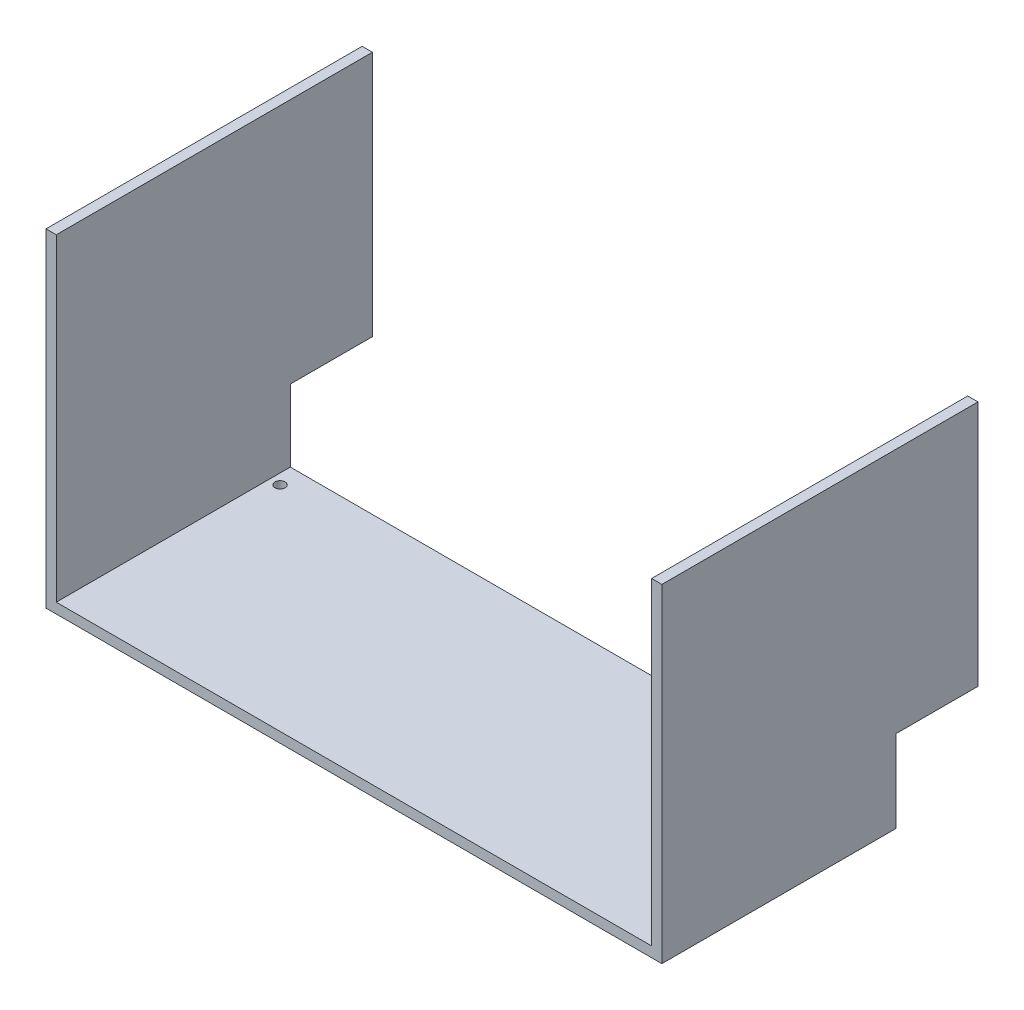
ISO-10303-21;
HEADER;
FILE_DESCRIPTION(('STEP AP214'),'2;1');
FILE_NAME('part.step','',(''),(''),'','','');
FILE_SCHEMA(('AUTOMOTIVE_DESIGN { 1 0 10303 214 1 1 1 1 }'));
ENDSEC;
DATA;
#1=APPLICATION_CONTEXT('core data for automotive mechanical design processes');
#2=APPLICATION_PROTOCOL_DEFINITION('international standard','automotive_design',2000,#1);
#3=PRODUCT_CONTEXT('',#1,'mechanical');
#4=PRODUCT('Part','Part','',(#3));
#5=PRODUCT_RELATED_PRODUCT_CATEGORY('part','',(#4));
#6=PRODUCT_DEFINITION_FORMATION('','',#4);
#7=PRODUCT_DEFINITION_CONTEXT('part definition',#1,'design');
#8=PRODUCT_DEFINITION('design','',#6,#7);
#9=PRODUCT_DEFINITION_SHAPE('','',#8);
#10=(LENGTH_UNIT() NAMED_UNIT(*) SI_UNIT(.MILLI.,.METRE.));
#11=(NAMED_UNIT(*) PLANE_ANGLE_UNIT() SI_UNIT($,.RADIAN.));
#12=(NAMED_UNIT(*) SI_UNIT($,.STERADIAN.) SOLID_ANGLE_UNIT());
#13=UNCERTAINTY_MEASURE_WITH_UNIT(LENGTH_MEASURE(1.E-05),#10,'distance_accuracy_value','');
#14=(GEOMETRIC_REPRESENTATION_CONTEXT(3) GLOBAL_UNCERTAINTY_ASSIGNED_CONTEXT((#13)) GLOBAL_UNIT_ASSIGNED_CONTEXT((#10,
#11,#12)) REPRESENTATION_CONTEXT('',''));
#15=CARTESIAN_POINT('',(0.,0.,0.));
#16=DIRECTION('',(0.,0.,1.));
#17=DIRECTION('',(1.,0.,0.));
#18=AXIS2_PLACEMENT_3D('',#15,#16,#17);
#19=CARTESIAN_POINT('',(0.,6.35,-429.26));
#20=DIRECTION('',(0.,0.,1.));
#21=DIRECTION('',(1.,0.,0.));
#22=AXIS2_PLACEMENT_3D('',#19,#20,#21);
#23=PLANE('',#22);
#24=DIRECTION('',(0.,1.,0.));
#25=VECTOR('',#24,1.);
#26=CARTESIAN_POINT('',(374.65,177.8,-429.26));
#27=LINE('',#26,#25);
#28=CARTESIAN_POINT('',(374.65,6.35,-429.26));
#29=VERTEX_POINT('',#28);
#30=CARTESIAN_POINT('',(374.65,50.8,-429.26));
#31=VERTEX_POINT('',#30);
#32=EDGE_CURVE('E146',#29,#31,#27,.T.);
#33=ORIENTED_EDGE('',*,*,#32,.T.);
#34=DIRECTION('',(-1.,0.,0.));
#35=VECTOR('',#34,1.);
#36=CARTESIAN_POINT('',(381.,50.8,-429.26));
#37=LINE('',#36,#35);
#38=CARTESIAN_POINT('',(381.,50.8,-429.26));
#39=VERTEX_POINT('',#38);
#40=EDGE_CURVE('E221',#39,#31,#37,.T.);
#41=ORIENTED_EDGE('',*,*,#40,.F.);
#42=DIRECTION('',(0.,-1.,0.));
#43=VECTOR('',#42,1.);
#44=CARTESIAN_POINT('',(381.,177.8,-429.26));
#45=LINE('',#44,#43);
#46=CARTESIAN_POINT('',(381.,0.,-429.26));
#47=VERTEX_POINT('',#46);
#48=EDGE_CURVE('E179',#39,#47,#45,.T.);
#49=ORIENTED_EDGE('',*,*,#48,.T.);
#50=DIRECTION('',(-1.,0.,0.));
#51=VECTOR('',#50,1.);
#52=CARTESIAN_POINT('',(0.,0.,-429.26));
#53=LINE('',#52,#51);
#54=CARTESIAN_POINT('',(0.,0.,-429.26));
#55=VERTEX_POINT('',#54);
#56=EDGE_CURVE('E41',#47,#55,#53,.T.);
#57=ORIENTED_EDGE('',*,*,#56,.T.);
#58=DIRECTION('',(0.,1.,0.));
#59=VECTOR('',#58,1.);
#60=CARTESIAN_POINT('',(0.,165.1,-429.26));
#61=LINE('',#60,#59);
#62=CARTESIAN_POINT('',(0.,50.8,-429.26));
#63=VERTEX_POINT('',#62);
#64=EDGE_CURVE('E181',#55,#63,#61,.T.);
#65=ORIENTED_EDGE('',*,*,#64,.T.);
#66=DIRECTION('',(-1.,0.,0.));
#67=VECTOR('',#66,1.);
#68=CARTESIAN_POINT('',(6.35,50.8,-429.26));
#69=LINE('',#68,#67);
#70=CARTESIAN_POINT('',(6.35,50.8,-429.26));
#71=VERTEX_POINT('',#70);
#72=EDGE_CURVE('E49',#71,#63,#69,.T.);
#73=ORIENTED_EDGE('',*,*,#72,.F.);
#74=DIRECTION('',(0.,-1.,0.));
#75=VECTOR('',#74,1.);
#76=CARTESIAN_POINT('',(6.35,165.1,-429.26));
#77=LINE('',#76,#75);
#78=CARTESIAN_POINT('',(6.35,6.34999999999999,-429.26));
#79=VERTEX_POINT('',#78);
#80=EDGE_CURVE('E158',#71,#79,#77,.T.);
#81=ORIENTED_EDGE('',*,*,#80,.T.);
#82=DIRECTION('',(-1.,0.,0.));
#83=VECTOR('',#82,1.);
#84=CARTESIAN_POINT('',(0.,6.35,-429.26));
#85=LINE('',#84,#83);
#86=EDGE_CURVE('E11',#29,#79,#85,.T.);
#87=ORIENTED_EDGE('',*,*,#86,.F.);
#88=EDGE_LOOP('',(#33,#41,#49,#57,#65,#73,#81,#87));
#89=FACE_BOUND('',#88,.T.);
#90=ADVANCED_FACE('F32',(#89),#23,.F.);
#91=CARTESIAN_POINT('',(0.,0.,0.));
#92=DIRECTION('',(0.,-1.,0.));
#93=DIRECTION('',(0.,0.,-1.));
#94=AXIS2_PLACEMENT_3D('',#91,#92,#93);
#95=PLANE('',#94);
#96=CARTESIAN_POINT('',(12.7,0.,-416.56));
#97=DIRECTION('',(0.,-1.,0.));
#98=DIRECTION('',(0.,0.,-1.));
#99=AXIS2_PLACEMENT_3D('',#96,#97,#98);
#100=CIRCLE('',#99,3.175);
#101=CARTESIAN_POINT('',(12.7,0.,-419.735));
#102=VERTEX_POINT('',#101);
#103=EDGE_CURVE('E261',#102,#102,#100,.T.);
#104=ORIENTED_EDGE('',*,*,#103,.F.);
#105=EDGE_LOOP('',(#104));
#106=FACE_BOUND('',#105,.T.);
#107=CARTESIAN_POINT('',(368.3,0.,-416.56));
#108=DIRECTION('',(0.,-1.,0.));
#109=DIRECTION('',(0.,0.,-1.));
#110=AXIS2_PLACEMENT_3D('',#107,#108,#109);
#111=CIRCLE('',#110,3.17499999999997);
#112=CARTESIAN_POINT('',(368.3,0.,-419.735));
#113=VERTEX_POINT('',#112);
#114=EDGE_CURVE('E131',#113,#113,#111,.T.);
#115=ORIENTED_EDGE('',*,*,#114,.F.);
#116=EDGE_LOOP('',(#115));
#117=FACE_BOUND('',#116,.T.);
#118=DIRECTION('',(1.,0.,0.));
#119=VECTOR('',#118,1.);
#120=CARTESIAN_POINT('',(0.,0.,-284.48));
#121=LINE('',#120,#119);
#122=CARTESIAN_POINT('',(0.,0.,-284.48));
#123=VERTEX_POINT('',#122);
#124=CARTESIAN_POINT('',(381.,0.,-284.48));
#125=VERTEX_POINT('',#124);
#126=EDGE_CURVE('E130',#123,#125,#121,.T.);
#127=ORIENTED_EDGE('',*,*,#126,.F.);
#128=DIRECTION('',(0.,0.,1.));
#129=VECTOR('',#128,1.);
#130=CARTESIAN_POINT('',(0.,0.,0.));
#131=LINE('',#130,#129);
#132=EDGE_CURVE('E147',#55,#123,#131,.T.);
#133=ORIENTED_EDGE('',*,*,#132,.F.);
#134=ORIENTED_EDGE('',*,*,#56,.F.);
#135=DIRECTION('',(0.,0.,-1.));
#136=VECTOR('',#135,1.);
#137=CARTESIAN_POINT('',(381.,0.,0.));
#138=LINE('',#137,#136);
#139=EDGE_CURVE('E150',#125,#47,#138,.T.);
#140=ORIENTED_EDGE('',*,*,#139,.F.);
#141=EDGE_LOOP('',(#127,#133,#134,#140));
#142=FACE_BOUND('',#141,.T.);
#143=ADVANCED_FACE('F290',(#106,#117,#142),#95,.T.);
#144=CARTESIAN_POINT('',(0.,6.35,0.));
#145=DIRECTION('',(1.,0.,0.));
#146=DIRECTION('',(0.,0.,-1.));
#147=AXIS2_PLACEMENT_3D('',#144,#145,#146);
#148=PLANE('',#147);
#149=ORIENTED_EDGE('',*,*,#132,.T.);
#150=DIRECTION('',(0.,-1.,0.));
#151=VECTOR('',#150,1.);
#152=CARTESIAN_POINT('',(0.,165.1,-284.48));
#153=LINE('',#152,#151);
#154=CARTESIAN_POINT('',(0.,203.2,-284.48));
#155=VERTEX_POINT('',#154);
#156=EDGE_CURVE('E152',#155,#123,#153,.T.);
#157=ORIENTED_EDGE('',*,*,#156,.F.);
#158=DIRECTION('',(0.,0.,1.));
#159=VECTOR('',#158,1.);
#160=CARTESIAN_POINT('',(0.,203.2,-284.48));
#161=LINE('',#160,#159);
#162=CARTESIAN_POINT('',(0.,203.2,-480.06));
#163=VERTEX_POINT('',#162);
#164=EDGE_CURVE('E218',#163,#155,#161,.T.);
#165=ORIENTED_EDGE('',*,*,#164,.F.);
#166=DIRECTION('',(0.,1.,0.));
#167=VECTOR('',#166,1.);
#168=CARTESIAN_POINT('',(0.,190.5,-480.06));
#169=LINE('',#168,#167);
#170=CARTESIAN_POINT('',(0.,50.8,-480.06));
#171=VERTEX_POINT('',#170);
#172=EDGE_CURVE('E195',#171,#163,#169,.T.);
#173=ORIENTED_EDGE('',*,*,#172,.F.);
#174=DIRECTION('',(0.,0.,1.));
#175=VECTOR('',#174,1.);
#176=CARTESIAN_POINT('',(0.,50.8,-480.06));
#177=LINE('',#176,#175);
#178=EDGE_CURVE('E190',#171,#63,#177,.T.);
#179=ORIENTED_EDGE('',*,*,#178,.T.);
#180=ORIENTED_EDGE('',*,*,#64,.F.);
#181=EDGE_LOOP('',(#149,#157,#165,#173,#179,#180));
#182=FACE_BOUND('',#181,.T.);
#183=ADVANCED_FACE('F34',(#182),#148,.F.);
#184=CARTESIAN_POINT('',(6.35,165.1,-429.26));
#185=DIRECTION('',(-1.,0.,0.));
#186=DIRECTION('',(0.,0.,1.));
#187=AXIS2_PLACEMENT_3D('',#184,#185,#186);
#188=PLANE('',#187);
#189=DIRECTION('',(0.,-1.,0.));
#190=VECTOR('',#189,1.);
#191=CARTESIAN_POINT('',(6.35000000000002,190.5,-480.06));
#192=LINE('',#191,#190);
#193=CARTESIAN_POINT('',(6.35000000000002,203.2,-480.06));
#194=VERTEX_POINT('',#193);
#195=CARTESIAN_POINT('',(6.35,50.8,-480.06));
#196=VERTEX_POINT('',#195);
#197=EDGE_CURVE('E188',#194,#196,#192,.T.);
#198=ORIENTED_EDGE('',*,*,#197,.F.);
#199=DIRECTION('',(0.,0.,-1.));
#200=VECTOR('',#199,1.);
#201=CARTESIAN_POINT('',(6.35000000000002,203.2,-284.48));
#202=LINE('',#201,#200);
#203=CARTESIAN_POINT('',(6.35000000000002,203.2,-284.48));
#204=VERTEX_POINT('',#203);
#205=EDGE_CURVE('E209',#204,#194,#202,.T.);
#206=ORIENTED_EDGE('',*,*,#205,.F.);
#207=DIRECTION('',(0.,1.,0.));
#208=VECTOR('',#207,1.);
#209=CARTESIAN_POINT('',(6.35000000000002,165.1,-284.48));
#210=LINE('',#209,#208);
#211=CARTESIAN_POINT('',(6.35000000000002,6.35,-284.48));
#212=VERTEX_POINT('',#211);
#213=EDGE_CURVE('E141',#212,#204,#210,.T.);
#214=ORIENTED_EDGE('',*,*,#213,.F.);
#215=DIRECTION('',(0.,0.,-1.));
#216=VECTOR('',#215,1.);
#217=CARTESIAN_POINT('',(6.35,6.35,-429.26));
#218=LINE('',#217,#216);
#219=EDGE_CURVE('E127',#212,#79,#218,.T.);
#220=ORIENTED_EDGE('',*,*,#219,.T.);
#221=ORIENTED_EDGE('',*,*,#80,.F.);
#222=DIRECTION('',(0.,0.,1.));
#223=VECTOR('',#222,1.);
#224=CARTESIAN_POINT('',(6.35,50.8,-480.06));
#225=LINE('',#224,#223);
#226=EDGE_CURVE('E200',#196,#71,#225,.T.);
#227=ORIENTED_EDGE('',*,*,#226,.F.);
#228=EDGE_LOOP('',(#198,#206,#214,#220,#221,#227));
#229=FACE_BOUND('',#228,.T.);
#230=ADVANCED_FACE('F206',(#229),#188,.F.);
#231=CARTESIAN_POINT('',(374.65,177.8,-429.26));
#232=DIRECTION('',(1.,0.,0.));
#233=DIRECTION('',(0.,0.,-1.));
#234=AXIS2_PLACEMENT_3D('',#231,#232,#233);
#235=PLANE('',#234);
#236=DIRECTION('',(0.,0.,1.));
#237=VECTOR('',#236,1.);
#238=CARTESIAN_POINT('',(374.65,203.2,-284.48));
#239=LINE('',#238,#237);
#240=CARTESIAN_POINT('',(374.65,203.2,-480.06));
#241=VERTEX_POINT('',#240);
#242=CARTESIAN_POINT('',(374.65,203.2,-284.48));
#243=VERTEX_POINT('',#242);
#244=EDGE_CURVE('E199',#241,#243,#239,.T.);
#245=ORIENTED_EDGE('',*,*,#244,.F.);
#246=DIRECTION('',(0.,1.,0.));
#247=VECTOR('',#246,1.);
#248=CARTESIAN_POINT('',(374.65,203.2,-480.06));
#249=LINE('',#248,#247);
#250=CARTESIAN_POINT('',(374.65,50.8,-480.06));
#251=VERTEX_POINT('',#250);
#252=EDGE_CURVE('E236',#251,#241,#249,.T.);
#253=ORIENTED_EDGE('',*,*,#252,.F.);
#254=DIRECTION('',(0.,0.,-1.));
#255=VECTOR('',#254,1.);
#256=CARTESIAN_POINT('',(374.65,50.8,-480.06));
#257=LINE('',#256,#255);
#258=EDGE_CURVE('E228',#31,#251,#257,.T.);
#259=ORIENTED_EDGE('',*,*,#258,.F.);
#260=ORIENTED_EDGE('',*,*,#32,.F.);
#261=DIRECTION('',(0.,0.,1.));
#262=VECTOR('',#261,1.);
#263=CARTESIAN_POINT('',(374.65,6.35,-429.26));
#264=LINE('',#263,#262);
#265=CARTESIAN_POINT('',(374.65,6.35,-284.48));
#266=VERTEX_POINT('',#265);
#267=EDGE_CURVE('E125',#29,#266,#264,.T.);
#268=ORIENTED_EDGE('',*,*,#267,.T.);
#269=DIRECTION('',(0.,-1.,0.));
#270=VECTOR('',#269,1.);
#271=CARTESIAN_POINT('',(374.65,6.35,-284.48));
#272=LINE('',#271,#270);
#273=EDGE_CURVE('E134',#243,#266,#272,.T.);
#274=ORIENTED_EDGE('',*,*,#273,.F.);
#275=EDGE_LOOP('',(#245,#253,#259,#260,#268,#274));
#276=FACE_BOUND('',#275,.T.);
#277=ADVANCED_FACE('F144',(#276),#235,.F.);
#278=CARTESIAN_POINT('',(0.,6.35,0.));
#279=DIRECTION('',(0.,-1.,0.));
#280=DIRECTION('',(0.,0.,-1.));
#281=AXIS2_PLACEMENT_3D('',#278,#279,#280);
#282=PLANE('',#281);
#283=CARTESIAN_POINT('',(12.7,6.35,-416.56));
#284=DIRECTION('',(0.,1.,0.));
#285=DIRECTION('',(0.,0.,1.));
#286=AXIS2_PLACEMENT_3D('',#283,#284,#285);
#287=CIRCLE('',#286,3.175);
#288=CARTESIAN_POINT('',(12.7,6.35,-413.385));
#289=VERTEX_POINT('',#288);
#290=EDGE_CURVE('E264',#289,#289,#287,.T.);
#291=ORIENTED_EDGE('',*,*,#290,.F.);
#292=EDGE_LOOP('',(#291));
#293=FACE_BOUND('',#292,.T.);
#294=CARTESIAN_POINT('',(368.3,6.35,-416.56));
#295=DIRECTION('',(0.,1.,0.));
#296=DIRECTION('',(0.,0.,1.));
#297=AXIS2_PLACEMENT_3D('',#294,#295,#296);
#298=CIRCLE('',#297,3.17499999999997);
#299=CARTESIAN_POINT('',(368.3,6.35,-413.385));
#300=VERTEX_POINT('',#299);
#301=EDGE_CURVE('E258',#300,#300,#298,.T.);
#302=ORIENTED_EDGE('',*,*,#301,.F.);
#303=EDGE_LOOP('',(#302));
#304=FACE_BOUND('',#303,.T.);
#305=ORIENTED_EDGE('',*,*,#219,.F.);
#306=DIRECTION('',(-1.,0.,0.));
#307=VECTOR('',#306,1.);
#308=CARTESIAN_POINT('',(0.,6.35,-284.48));
#309=LINE('',#308,#307);
#310=EDGE_CURVE('E121',#266,#212,#309,.T.);
#311=ORIENTED_EDGE('',*,*,#310,.F.);
#312=ORIENTED_EDGE('',*,*,#267,.F.);
#313=ORIENTED_EDGE('',*,*,#86,.T.);
#314=EDGE_LOOP('',(#305,#311,#312,#313));
#315=FACE_BOUND('',#314,.T.);
#316=ADVANCED_FACE('F123',(#293,#304,#315),#282,.F.);
#317=CARTESIAN_POINT('',(381.,6.35,0.));
#318=DIRECTION('',(-1.,0.,0.));
#319=DIRECTION('',(0.,0.,1.));
#320=AXIS2_PLACEMENT_3D('',#317,#318,#319);
#321=PLANE('',#320);
#322=DIRECTION('',(0.,1.,0.));
#323=VECTOR('',#322,1.);
#324=CARTESIAN_POINT('',(381.,6.35,-284.48));
#325=LINE('',#324,#323);
#326=CARTESIAN_POINT('',(381.,203.2,-284.48));
#327=VERTEX_POINT('',#326);
#328=EDGE_CURVE('E142',#125,#327,#325,.T.);
#329=ORIENTED_EDGE('',*,*,#328,.F.);
#330=ORIENTED_EDGE('',*,*,#139,.T.);
#331=ORIENTED_EDGE('',*,*,#48,.F.);
#332=DIRECTION('',(0.,0.,1.));
#333=VECTOR('',#332,1.);
#334=CARTESIAN_POINT('',(381.,50.8,-480.06));
#335=LINE('',#334,#333);
#336=CARTESIAN_POINT('',(381.,50.8,-480.06));
#337=VERTEX_POINT('',#336);
#338=EDGE_CURVE('E219',#337,#39,#335,.T.);
#339=ORIENTED_EDGE('',*,*,#338,.F.);
#340=DIRECTION('',(0.,-1.,0.));
#341=VECTOR('',#340,1.);
#342=CARTESIAN_POINT('',(381.,203.2,-480.06));
#343=LINE('',#342,#341);
#344=CARTESIAN_POINT('',(381.,203.2,-480.06));
#345=VERTEX_POINT('',#344);
#346=EDGE_CURVE('E234',#345,#337,#343,.T.);
#347=ORIENTED_EDGE('',*,*,#346,.F.);
#348=DIRECTION('',(0.,0.,-1.));
#349=VECTOR('',#348,1.);
#350=CARTESIAN_POINT('',(381.,203.2,-284.48));
#351=LINE('',#350,#349);
#352=EDGE_CURVE('E197',#327,#345,#351,.T.);
#353=ORIENTED_EDGE('',*,*,#352,.F.);
#354=EDGE_LOOP('',(#329,#330,#331,#339,#347,#353));
#355=FACE_BOUND('',#354,.T.);
#356=ADVANCED_FACE('F272',(#355),#321,.F.);
#357=CARTESIAN_POINT('',(0.,0.,-284.48));
#358=DIRECTION('',(0.,0.,-1.));
#359=DIRECTION('',(-1.,0.,0.));
#360=AXIS2_PLACEMENT_3D('',#357,#358,#359);
#361=PLANE('',#360);
#362=ORIENTED_EDGE('',*,*,#156,.T.);
#363=ORIENTED_EDGE('',*,*,#126,.T.);
#364=ORIENTED_EDGE('',*,*,#328,.T.);
#365=DIRECTION('',(1.,0.,0.));
#366=VECTOR('',#365,1.);
#367=CARTESIAN_POINT('',(381.,203.2,-284.48));
#368=LINE('',#367,#366);
#369=EDGE_CURVE('E137',#243,#327,#368,.T.);
#370=ORIENTED_EDGE('',*,*,#369,.F.);
#371=ORIENTED_EDGE('',*,*,#273,.T.);
#372=ORIENTED_EDGE('',*,*,#310,.T.);
#373=ORIENTED_EDGE('',*,*,#213,.T.);
#374=DIRECTION('',(1.,0.,0.));
#375=VECTOR('',#374,1.);
#376=CARTESIAN_POINT('',(6.35000000000002,203.2,-284.48));
#377=LINE('',#376,#375);
#378=EDGE_CURVE('E212',#155,#204,#377,.T.);
#379=ORIENTED_EDGE('',*,*,#378,.F.);
#380=EDGE_LOOP('',(#362,#363,#364,#370,#371,#372,#373,#379));
#381=FACE_BOUND('',#380,.T.);
#382=ADVANCED_FACE('F135',(#381),#361,.F.);
#383=CARTESIAN_POINT('',(0.,203.2,0.));
#384=DIRECTION('',(0.,1.,0.));
#385=DIRECTION('',(0.,0.,1.));
#386=AXIS2_PLACEMENT_3D('',#383,#384,#385);
#387=PLANE('',#386);
#388=ORIENTED_EDGE('',*,*,#352,.T.);
#389=DIRECTION('',(1.,0.,0.));
#390=VECTOR('',#389,1.);
#391=CARTESIAN_POINT('',(381.,203.2,-480.06));
#392=LINE('',#391,#390);
#393=EDGE_CURVE('E189',#241,#345,#392,.T.);
#394=ORIENTED_EDGE('',*,*,#393,.F.);
#395=ORIENTED_EDGE('',*,*,#244,.T.);
#396=ORIENTED_EDGE('',*,*,#369,.T.);
#397=EDGE_LOOP('',(#388,#394,#395,#396));
#398=FACE_BOUND('',#397,.T.);
#399=ADVANCED_FACE('F303',(#398),#387,.T.);
#400=CARTESIAN_POINT('',(6.35,50.8,-480.06));
#401=DIRECTION('',(0.,1.,0.));
#402=DIRECTION('',(0.,0.,1.));
#403=AXIS2_PLACEMENT_3D('',#400,#401,#402);
#404=PLANE('',#403);
#405=ORIENTED_EDGE('',*,*,#72,.T.);
#406=ORIENTED_EDGE('',*,*,#178,.F.);
#407=DIRECTION('',(-1.,0.,0.));
#408=VECTOR('',#407,1.);
#409=CARTESIAN_POINT('',(6.35,50.8,-480.06));
#410=LINE('',#409,#408);
#411=EDGE_CURVE('E240',#196,#171,#410,.T.);
#412=ORIENTED_EDGE('',*,*,#411,.F.);
#413=ORIENTED_EDGE('',*,*,#226,.T.);
#414=EDGE_LOOP('',(#405,#406,#412,#413));
#415=FACE_BOUND('',#414,.T.);
#416=ADVANCED_FACE('F250',(#415),#404,.F.);
#417=CARTESIAN_POINT('',(0.,0.,-480.06));
#418=DIRECTION('',(0.,0.,-1.));
#419=DIRECTION('',(-1.,0.,0.));
#420=AXIS2_PLACEMENT_3D('',#417,#418,#419);
#421=PLANE('',#420);
#422=ORIENTED_EDGE('',*,*,#197,.T.);
#423=ORIENTED_EDGE('',*,*,#411,.T.);
#424=ORIENTED_EDGE('',*,*,#172,.T.);
#425=DIRECTION('',(-1.,0.,0.));
#426=VECTOR('',#425,1.);
#427=CARTESIAN_POINT('',(6.35000000000002,203.2,-480.06));
#428=LINE('',#427,#426);
#429=EDGE_CURVE('E223',#194,#163,#428,.T.);
#430=ORIENTED_EDGE('',*,*,#429,.F.);
#431=EDGE_LOOP('',(#422,#423,#424,#430));
#432=FACE_BOUND('',#431,.T.);
#433=ADVANCED_FACE('F251',(#432),#421,.T.);
#434=CARTESIAN_POINT('',(0.,0.,-480.06));
#435=DIRECTION('',(0.,0.,-1.));
#436=DIRECTION('',(-1.,0.,0.));
#437=AXIS2_PLACEMENT_3D('',#434,#435,#436);
#438=PLANE('',#437);
#439=ORIENTED_EDGE('',*,*,#346,.T.);
#440=DIRECTION('',(1.,0.,0.));
#441=VECTOR('',#440,1.);
#442=CARTESIAN_POINT('',(381.,50.8,-480.06));
#443=LINE('',#442,#441);
#444=EDGE_CURVE('E231',#251,#337,#443,.T.);
#445=ORIENTED_EDGE('',*,*,#444,.F.);
#446=ORIENTED_EDGE('',*,*,#252,.T.);
#447=ORIENTED_EDGE('',*,*,#393,.T.);
#448=EDGE_LOOP('',(#439,#445,#446,#447));
#449=FACE_BOUND('',#448,.T.);
#450=ADVANCED_FACE('F325',(#449),#438,.T.);
#451=CARTESIAN_POINT('',(0.,50.8,0.));
#452=DIRECTION('',(0.,-1.,0.));
#453=DIRECTION('',(0.,0.,-1.));
#454=AXIS2_PLACEMENT_3D('',#451,#452,#453);
#455=PLANE('',#454);
#456=ORIENTED_EDGE('',*,*,#338,.T.);
#457=ORIENTED_EDGE('',*,*,#40,.T.);
#458=ORIENTED_EDGE('',*,*,#258,.T.);
#459=ORIENTED_EDGE('',*,*,#444,.T.);
#460=EDGE_LOOP('',(#456,#457,#458,#459));
#461=FACE_BOUND('',#460,.T.);
#462=ADVANCED_FACE('F287',(#461),#455,.T.);
#463=CARTESIAN_POINT('',(0.,203.2,0.));
#464=DIRECTION('',(0.,1.,0.));
#465=DIRECTION('',(0.,0.,1.));
#466=AXIS2_PLACEMENT_3D('',#463,#464,#465);
#467=PLANE('',#466);
#468=ORIENTED_EDGE('',*,*,#205,.T.);
#469=ORIENTED_EDGE('',*,*,#429,.T.);
#470=ORIENTED_EDGE('',*,*,#164,.T.);
#471=ORIENTED_EDGE('',*,*,#378,.T.);
#472=EDGE_LOOP('',(#468,#469,#470,#471));
#473=FACE_BOUND('',#472,.T.);
#474=ADVANCED_FACE('F215',(#473),#467,.T.);
#475=CARTESIAN_POINT('',(368.3,-628.65,-416.56));
#476=DIRECTION('',(0.,1.,0.));
#477=DIRECTION('',(0.,0.,1.));
#478=AXIS2_PLACEMENT_3D('',#475,#476,#477);
#479=CYLINDRICAL_SURFACE('',#478,3.17499999999997);
#480=ORIENTED_EDGE('',*,*,#114,.T.);
#481=EDGE_LOOP('',(#480));
#482=FACE_BOUND('',#481,.T.);
#483=ORIENTED_EDGE('',*,*,#301,.T.);
#484=EDGE_LOOP('',(#483));
#485=FACE_BOUND('',#484,.T.);
#486=ADVANCED_FACE('F276',(#482,#485),#479,.F.);
#487=CARTESIAN_POINT('',(12.7,-628.65,-416.56));
#488=DIRECTION('',(0.,1.,0.));
#489=DIRECTION('',(0.,0.,1.));
#490=AXIS2_PLACEMENT_3D('',#487,#488,#489);
#491=CYLINDRICAL_SURFACE('',#490,3.175);
#492=ORIENTED_EDGE('',*,*,#103,.T.);
#493=EDGE_LOOP('',(#492));
#494=FACE_BOUND('',#493,.T.);
#495=ORIENTED_EDGE('',*,*,#290,.T.);
#496=EDGE_LOOP('',(#495));
#497=FACE_BOUND('',#496,.T.);
#498=ADVANCED_FACE('F268',(#494,#497),#491,.F.);
#499=CLOSED_SHELL('',(#90,#143,#183,#230,#277,#316,#356,#382,#399,#416,#433,#450,#462,#474,#486,#498));
#500=MANIFOLD_SOLID_BREP('B2',#499);
#501=ADVANCED_BREP_SHAPE_REPRESENTATION('',(#18,#500),#14);
#502=SHAPE_DEFINITION_REPRESENTATION(#9,#501);
ENDSEC;
END-ISO-10303-21;
